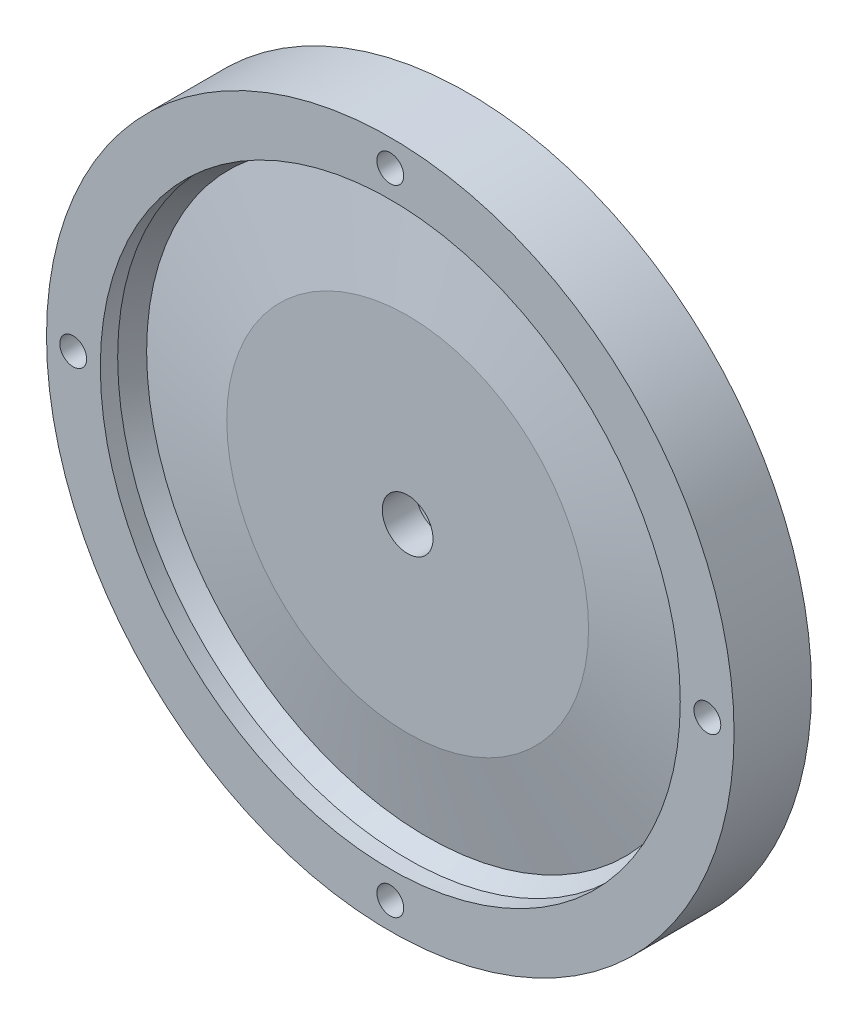
ISO-10303-21;
HEADER;
FILE_DESCRIPTION(('STEP AP214'),'2;1');
FILE_NAME('part.step','',(''),(''),'','','');
FILE_SCHEMA(('AUTOMOTIVE_DESIGN { 1 0 10303 214 1 1 1 1 }'));
ENDSEC;
DATA;
#1=APPLICATION_CONTEXT('core data for automotive mechanical design processes');
#2=APPLICATION_PROTOCOL_DEFINITION('international standard','automotive_design',2000,#1);
#3=PRODUCT_CONTEXT('',#1,'mechanical');
#4=PRODUCT('Part','Part','',(#3));
#5=PRODUCT_RELATED_PRODUCT_CATEGORY('part','',(#4));
#6=PRODUCT_DEFINITION_FORMATION('','',#4);
#7=PRODUCT_DEFINITION_CONTEXT('part definition',#1,'design');
#8=PRODUCT_DEFINITION('design','',#6,#7);
#9=PRODUCT_DEFINITION_SHAPE('','',#8);
#10=(LENGTH_UNIT() NAMED_UNIT(*) SI_UNIT(.MILLI.,.METRE.));
#11=(NAMED_UNIT(*) PLANE_ANGLE_UNIT() SI_UNIT($,.RADIAN.));
#12=(NAMED_UNIT(*) SI_UNIT($,.STERADIAN.) SOLID_ANGLE_UNIT());
#13=UNCERTAINTY_MEASURE_WITH_UNIT(LENGTH_MEASURE(1.E-05),#10,'distance_accuracy_value','');
#14=(GEOMETRIC_REPRESENTATION_CONTEXT(3) GLOBAL_UNCERTAINTY_ASSIGNED_CONTEXT((#13)) GLOBAL_UNIT_ASSIGNED_CONTEXT((#10,
#11,#12)) REPRESENTATION_CONTEXT('',''));
#15=CARTESIAN_POINT('',(0.,0.,0.));
#16=DIRECTION('',(0.,0.,1.));
#17=DIRECTION('',(1.,0.,0.));
#18=AXIS2_PLACEMENT_3D('',#15,#16,#17);
#19=CARTESIAN_POINT('',(0.,0.,5.08));
#20=DIRECTION('',(0.,0.,-1.));
#21=DIRECTION('',(-1.,0.,0.));
#22=AXIS2_PLACEMENT_3D('',#19,#20,#21);
#23=PLANE('',#22);
#24=CARTESIAN_POINT('',(0.,0.,5.08));
#25=DIRECTION('',(0.,0.,-1.));
#26=DIRECTION('',(-1.,0.,0.));
#27=AXIS2_PLACEMENT_3D('',#24,#25,#26);
#28=CIRCLE('',#27,4.826);
#29=CARTESIAN_POINT('',(-4.826,0.,5.08));
#30=VERTEX_POINT('',#29);
#31=EDGE_CURVE('E157',#30,#30,#28,.T.);
#32=ORIENTED_EDGE('',*,*,#31,.F.);
#33=EDGE_LOOP('',(#32));
#34=FACE_BOUND('',#33,.T.);
#35=CARTESIAN_POINT('',(0.,0.,5.08));
#36=DIRECTION('',(0.,0.,-1.));
#37=DIRECTION('',(-1.,0.,0.));
#38=AXIS2_PLACEMENT_3D('',#35,#36,#37);
#39=CIRCLE('',#38,45.72);
#40=CARTESIAN_POINT('',(-45.72,0.,5.08));
#41=VERTEX_POINT('',#40);
#42=EDGE_CURVE('E164',#41,#41,#39,.T.);
#43=ORIENTED_EDGE('',*,*,#42,.T.);
#44=EDGE_LOOP('',(#43));
#45=FACE_BOUND('',#44,.T.);
#46=DIRECTION('',(-1.,0.,0.));
#47=VECTOR('',#46,1.);
#48=CARTESIAN_POINT('',(-9.42734439012387,6.35,5.08));
#49=LINE('',#48,#47);
#50=CARTESIAN_POINT('',(-9.42734439012387,6.35,5.08));
#51=VERTEX_POINT('',#50);
#52=CARTESIAN_POINT('',(-13.2932059338596,6.35,5.08));
#53=VERTEX_POINT('',#52);
#54=EDGE_CURVE('E129',#51,#53,#49,.T.);
#55=ORIENTED_EDGE('',*,*,#54,.F.);
#56=CARTESIAN_POINT('',(0.,0.,5.08));
#57=DIRECTION('',(0.,0.,1.));
#58=DIRECTION('',(-1.,0.,0.));
#59=AXIS2_PLACEMENT_3D('',#56,#57,#58);
#60=CIRCLE('',#59,11.3665);
#61=CARTESIAN_POINT('',(9.42734439012387,6.35,5.08));
#62=VERTEX_POINT('',#61);
#63=EDGE_CURVE('E126',#62,#51,#60,.T.);
#64=ORIENTED_EDGE('',*,*,#63,.F.);
#65=DIRECTION('',(-1.,0.,0.));
#66=VECTOR('',#65,1.);
#67=CARTESIAN_POINT('',(13.2932059338596,6.35,5.08));
#68=LINE('',#67,#66);
#69=CARTESIAN_POINT('',(13.2932059338596,6.35,5.08));
#70=VERTEX_POINT('',#69);
#71=EDGE_CURVE('E138',#70,#62,#68,.T.);
#72=ORIENTED_EDGE('',*,*,#71,.F.);
#73=CARTESIAN_POINT('',(0.,0.,5.08));
#74=DIRECTION('',(0.,0.,-1.));
#75=DIRECTION('',(-1.,0.,0.));
#76=AXIS2_PLACEMENT_3D('',#73,#74,#75);
#77=CIRCLE('',#76,14.732);
#78=EDGE_CURVE('E146',#53,#70,#77,.T.);
#79=ORIENTED_EDGE('',*,*,#78,.F.);
#80=EDGE_LOOP('',(#55,#64,#72,#79));
#81=FACE_BOUND('',#80,.T.);
#82=DIRECTION('',(1.,0.,0.));
#83=VECTOR('',#82,1.);
#84=CARTESIAN_POINT('',(13.2932059338596,-6.35,5.08));
#85=LINE('',#84,#83);
#86=CARTESIAN_POINT('',(9.42734439012387,-6.35,5.08));
#87=VERTEX_POINT('',#86);
#88=CARTESIAN_POINT('',(13.2932059338596,-6.35,5.08));
#89=VERTEX_POINT('',#88);
#90=EDGE_CURVE('E462',#87,#89,#85,.T.);
#91=ORIENTED_EDGE('',*,*,#90,.F.);
#92=CARTESIAN_POINT('',(0.,0.,5.08));
#93=DIRECTION('',(0.,0.,1.));
#94=DIRECTION('',(-1.,0.,0.));
#95=AXIS2_PLACEMENT_3D('',#92,#93,#94);
#96=CIRCLE('',#95,11.3665);
#97=CARTESIAN_POINT('',(-9.42734439012387,-6.35,5.08));
#98=VERTEX_POINT('',#97);
#99=EDGE_CURVE('E124',#98,#87,#96,.T.);
#100=ORIENTED_EDGE('',*,*,#99,.F.);
#101=DIRECTION('',(1.,0.,0.));
#102=VECTOR('',#101,1.);
#103=CARTESIAN_POINT('',(-9.42734439012387,-6.35,5.08));
#104=LINE('',#103,#102);
#105=CARTESIAN_POINT('',(-13.2932059338596,-6.35,5.08));
#106=VERTEX_POINT('',#105);
#107=EDGE_CURVE('E120',#106,#98,#104,.T.);
#108=ORIENTED_EDGE('',*,*,#107,.F.);
#109=CARTESIAN_POINT('',(0.,0.,5.08));
#110=DIRECTION('',(0.,0.,-1.));
#111=DIRECTION('',(-1.,0.,0.));
#112=AXIS2_PLACEMENT_3D('',#109,#110,#111);
#113=CIRCLE('',#112,14.732);
#114=EDGE_CURVE('E459',#89,#106,#113,.T.);
#115=ORIENTED_EDGE('',*,*,#114,.F.);
#116=EDGE_LOOP('',(#91,#100,#108,#115));
#117=FACE_BOUND('',#116,.T.);
#118=ADVANCED_FACE('F35',(#34,#45,#81,#117),#23,.T.);
#119=CARTESIAN_POINT('',(0.,0.,14.732));
#120=DIRECTION('',(0.,0.,-1.));
#121=DIRECTION('',(-1.,0.,0.));
#122=AXIS2_PLACEMENT_3D('',#119,#120,#121);
#123=CYLINDRICAL_SURFACE('',#122,65.405);
#124=CARTESIAN_POINT('',(0.,0.,14.732));
#125=DIRECTION('',(0.,0.,1.));
#126=DIRECTION('',(1.,0.,0.));
#127=AXIS2_PLACEMENT_3D('',#124,#125,#126);
#128=CIRCLE('',#127,65.405);
#129=CARTESIAN_POINT('',(65.405,0.,14.732));
#130=VERTEX_POINT('',#129);
#131=EDGE_CURVE('E11',#130,#130,#128,.T.);
#132=ORIENTED_EDGE('',*,*,#131,.F.);
#133=EDGE_LOOP('',(#132));
#134=FACE_BOUND('',#133,.T.);
#135=CARTESIAN_POINT('',(0.,0.,0.));
#136=DIRECTION('',(0.,0.,1.));
#137=DIRECTION('',(1.,0.,0.));
#138=AXIS2_PLACEMENT_3D('',#135,#136,#137);
#139=CIRCLE('',#138,65.405);
#140=CARTESIAN_POINT('',(65.405,0.,0.));
#141=VERTEX_POINT('',#140);
#142=EDGE_CURVE('E39',#141,#141,#139,.T.);
#143=ORIENTED_EDGE('',*,*,#142,.T.);
#144=EDGE_LOOP('',(#143));
#145=FACE_BOUND('',#144,.T.);
#146=ADVANCED_FACE('F37',(#134,#145),#123,.T.);
#147=CARTESIAN_POINT('',(0.,0.,14.732));
#148=DIRECTION('',(0.,0.,1.));
#149=DIRECTION('',(1.,0.,0.));
#150=AXIS2_PLACEMENT_3D('',#147,#148,#149);
#151=PLANE('',#150);
#152=CARTESIAN_POINT('',(0.,60.325,14.732));
#153=DIRECTION('',(0.,0.,1.));
#154=DIRECTION('',(1.,0.,0.));
#155=AXIS2_PLACEMENT_3D('',#152,#153,#154);
#156=CIRCLE('',#155,2.5527);
#157=CARTESIAN_POINT('',(2.5527,60.325,14.732));
#158=VERTEX_POINT('',#157);
#159=EDGE_CURVE('E167',#158,#158,#156,.T.);
#160=ORIENTED_EDGE('',*,*,#159,.F.);
#161=EDGE_LOOP('',(#160));
#162=FACE_BOUND('',#161,.T.);
#163=CARTESIAN_POINT('',(60.325,0.,14.732));
#164=DIRECTION('',(0.,0.,1.));
#165=DIRECTION('',(1.,0.,0.));
#166=AXIS2_PLACEMENT_3D('',#163,#164,#165);
#167=CIRCLE('',#166,2.5527);
#168=CARTESIAN_POINT('',(62.8777,0.,14.732));
#169=VERTEX_POINT('',#168);
#170=EDGE_CURVE('E175',#169,#169,#167,.T.);
#171=ORIENTED_EDGE('',*,*,#170,.F.);
#172=EDGE_LOOP('',(#171));
#173=FACE_BOUND('',#172,.T.);
#174=CARTESIAN_POINT('',(0.,-60.325,14.732));
#175=DIRECTION('',(0.,0.,1.));
#176=DIRECTION('',(1.,0.,0.));
#177=AXIS2_PLACEMENT_3D('',#174,#175,#176);
#178=CIRCLE('',#177,2.5527);
#179=CARTESIAN_POINT('',(2.5527,-60.325,14.732));
#180=VERTEX_POINT('',#179);
#181=EDGE_CURVE('E181',#180,#180,#178,.T.);
#182=ORIENTED_EDGE('',*,*,#181,.F.);
#183=EDGE_LOOP('',(#182));
#184=FACE_BOUND('',#183,.T.);
#185=CARTESIAN_POINT('',(-60.325,0.,14.732));
#186=DIRECTION('',(0.,0.,1.));
#187=DIRECTION('',(1.,0.,0.));
#188=AXIS2_PLACEMENT_3D('',#185,#186,#187);
#189=CIRCLE('',#188,2.5527);
#190=CARTESIAN_POINT('',(-57.7723,0.,14.732));
#191=VERTEX_POINT('',#190);
#192=EDGE_CURVE('E187',#191,#191,#189,.T.);
#193=ORIENTED_EDGE('',*,*,#192,.F.);
#194=EDGE_LOOP('',(#193));
#195=FACE_BOUND('',#194,.T.);
#196=CARTESIAN_POINT('',(0.,0.,14.732));
#197=DIRECTION('',(0.,0.,1.));
#198=DIRECTION('',(1.,0.,0.));
#199=AXIS2_PLACEMENT_3D('',#196,#197,#198);
#200=CIRCLE('',#199,55.1688);
#201=CARTESIAN_POINT('',(55.1688,0.,14.732));
#202=VERTEX_POINT('',#201);
#203=EDGE_CURVE('E202',#202,#202,#200,.T.);
#204=ORIENTED_EDGE('',*,*,#203,.F.);
#205=EDGE_LOOP('',(#204));
#206=FACE_BOUND('',#205,.T.);
#207=ORIENTED_EDGE('',*,*,#131,.T.);
#208=EDGE_LOOP('',(#207));
#209=FACE_BOUND('',#208,.T.);
#210=ADVANCED_FACE('F213',(#162,#173,#184,#195,#206,#209),#151,.T.);
#211=CARTESIAN_POINT('',(0.,0.,0.));
#212=DIRECTION('',(0.,0.,1.));
#213=DIRECTION('',(1.,0.,0.));
#214=AXIS2_PLACEMENT_3D('',#211,#212,#213);
#215=PLANE('',#214);
#216=CARTESIAN_POINT('',(0.,0.,0.));
#217=DIRECTION('',(0.,0.,-1.));
#218=DIRECTION('',(-1.,0.,0.));
#219=AXIS2_PLACEMENT_3D('',#216,#217,#218);
#220=CIRCLE('',#219,45.72);
#221=CARTESIAN_POINT('',(-45.72,0.,0.));
#222=VERTEX_POINT('',#221);
#223=EDGE_CURVE('E163',#222,#222,#220,.T.);
#224=ORIENTED_EDGE('',*,*,#223,.F.);
#225=EDGE_LOOP('',(#224));
#226=FACE_BOUND('',#225,.T.);
#227=CARTESIAN_POINT('',(0.,60.325,0.));
#228=DIRECTION('',(0.,0.,1.));
#229=DIRECTION('',(1.,0.,0.));
#230=AXIS2_PLACEMENT_3D('',#227,#228,#229);
#231=CIRCLE('',#230,2.5527);
#232=CARTESIAN_POINT('',(2.5527,60.325,0.));
#233=VERTEX_POINT('',#232);
#234=EDGE_CURVE('E172',#233,#233,#231,.T.);
#235=ORIENTED_EDGE('',*,*,#234,.T.);
#236=EDGE_LOOP('',(#235));
#237=FACE_BOUND('',#236,.T.);
#238=CARTESIAN_POINT('',(60.325,0.,0.));
#239=DIRECTION('',(0.,0.,1.));
#240=DIRECTION('',(1.,0.,0.));
#241=AXIS2_PLACEMENT_3D('',#238,#239,#240);
#242=CIRCLE('',#241,2.5527);
#243=CARTESIAN_POINT('',(62.8777,0.,0.));
#244=VERTEX_POINT('',#243);
#245=EDGE_CURVE('E178',#244,#244,#242,.T.);
#246=ORIENTED_EDGE('',*,*,#245,.T.);
#247=EDGE_LOOP('',(#246));
#248=FACE_BOUND('',#247,.T.);
#249=CARTESIAN_POINT('',(0.,-60.325,0.));
#250=DIRECTION('',(0.,0.,1.));
#251=DIRECTION('',(1.,0.,0.));
#252=AXIS2_PLACEMENT_3D('',#249,#250,#251);
#253=CIRCLE('',#252,2.5527);
#254=CARTESIAN_POINT('',(2.5527,-60.325,0.));
#255=VERTEX_POINT('',#254);
#256=EDGE_CURVE('E184',#255,#255,#253,.T.);
#257=ORIENTED_EDGE('',*,*,#256,.T.);
#258=EDGE_LOOP('',(#257));
#259=FACE_BOUND('',#258,.T.);
#260=CARTESIAN_POINT('',(-60.325,0.,0.));
#261=DIRECTION('',(0.,0.,1.));
#262=DIRECTION('',(1.,0.,0.));
#263=AXIS2_PLACEMENT_3D('',#260,#261,#262);
#264=CIRCLE('',#263,2.5527);
#265=CARTESIAN_POINT('',(-57.7723,0.,0.));
#266=VERTEX_POINT('',#265);
#267=EDGE_CURVE('E190',#266,#266,#264,.T.);
#268=ORIENTED_EDGE('',*,*,#267,.T.);
#269=EDGE_LOOP('',(#268));
#270=FACE_BOUND('',#269,.T.);
#271=ORIENTED_EDGE('',*,*,#142,.F.);
#272=EDGE_LOOP('',(#271));
#273=FACE_BOUND('',#272,.T.);
#274=ADVANCED_FACE('F210',(#226,#237,#248,#259,#270,#273),#215,.F.);
#275=CARTESIAN_POINT('',(0.,0.,11.43));
#276=DIRECTION('',(0.,0.,1.));
#277=DIRECTION('',(1.,0.,0.));
#278=AXIS2_PLACEMENT_3D('',#275,#276,#277);
#279=CYLINDRICAL_SURFACE('',#278,55.1688);
#280=CARTESIAN_POINT('',(0.,0.,11.43));
#281=DIRECTION('',(0.,0.,-1.));
#282=DIRECTION('',(-1.,0.,0.));
#283=AXIS2_PLACEMENT_3D('',#280,#281,#282);
#284=CIRCLE('',#283,55.1688);
#285=CARTESIAN_POINT('',(-55.1688,0.,11.43));
#286=VERTEX_POINT('',#285);
#287=EDGE_CURVE('E199',#286,#286,#284,.T.);
#288=ORIENTED_EDGE('',*,*,#287,.T.);
#289=EDGE_LOOP('',(#288));
#290=FACE_BOUND('',#289,.T.);
#291=ORIENTED_EDGE('',*,*,#203,.T.);
#292=EDGE_LOOP('',(#291));
#293=FACE_BOUND('',#292,.T.);
#294=ADVANCED_FACE('F212',(#290,#293),#279,.F.);
#295=CARTESIAN_POINT('',(0.,0.,7.747));
#296=DIRECTION('',(0.,0.,1.));
#297=DIRECTION('',(1.,0.,0.));
#298=AXIS2_PLACEMENT_3D('',#295,#296,#297);
#299=CONICAL_SURFACE('',#298,53.34,0.460885185088275);
#300=ORIENTED_EDGE('',*,*,#287,.F.);
#301=EDGE_LOOP('',(#300));
#302=FACE_BOUND('',#301,.T.);
#303=CARTESIAN_POINT('',(0.,0.,7.747));
#304=DIRECTION('',(0.,0.,-1.));
#305=DIRECTION('',(-1.,0.,0.));
#306=AXIS2_PLACEMENT_3D('',#303,#304,#305);
#307=CIRCLE('',#306,53.34);
#308=CARTESIAN_POINT('',(-53.34,0.,7.747));
#309=VERTEX_POINT('',#308);
#310=EDGE_CURVE('E196',#309,#309,#307,.T.);
#311=ORIENTED_EDGE('',*,*,#310,.T.);
#312=EDGE_LOOP('',(#311));
#313=FACE_BOUND('',#312,.T.);
#314=ADVANCED_FACE('F220',(#302,#313),#299,.F.);
#315=CARTESIAN_POINT('',(0.,0.,11.43));
#316=DIRECTION('',(0.,0.,-1.));
#317=DIRECTION('',(-1.,0.,0.));
#318=AXIS2_PLACEMENT_3D('',#315,#316,#317);
#319=CONICAL_SURFACE('',#318,34.417,1.37856867959382);
#320=ORIENTED_EDGE('',*,*,#310,.F.);
#321=EDGE_LOOP('',(#320));
#322=FACE_BOUND('',#321,.T.);
#323=CARTESIAN_POINT('',(0.,0.,11.43));
#324=DIRECTION('',(0.,0.,-1.));
#325=DIRECTION('',(-1.,0.,0.));
#326=AXIS2_PLACEMENT_3D('',#323,#324,#325);
#327=CIRCLE('',#326,34.417);
#328=CARTESIAN_POINT('',(-34.417,0.,11.43));
#329=VERTEX_POINT('',#328);
#330=EDGE_CURVE('E193',#329,#329,#327,.T.);
#331=ORIENTED_EDGE('',*,*,#330,.T.);
#332=EDGE_LOOP('',(#331));
#333=FACE_BOUND('',#332,.T.);
#334=ADVANCED_FACE('F264',(#322,#333),#319,.T.);
#335=CARTESIAN_POINT('',(0.,0.,11.43));
#336=DIRECTION('',(0.,0.,1.));
#337=DIRECTION('',(1.,0.,0.));
#338=AXIS2_PLACEMENT_3D('',#335,#336,#337);
#339=PLANE('',#338);
#340=CARTESIAN_POINT('',(0.,0.,11.43));
#341=DIRECTION('',(0.,0.,1.));
#342=DIRECTION('',(1.,0.,0.));
#343=AXIS2_PLACEMENT_3D('',#340,#341,#342);
#344=CIRCLE('',#343,4.826);
#345=CARTESIAN_POINT('',(4.826,0.,11.43));
#346=VERTEX_POINT('',#345);
#347=EDGE_CURVE('E160',#346,#346,#344,.T.);
#348=ORIENTED_EDGE('',*,*,#347,.F.);
#349=EDGE_LOOP('',(#348));
#350=FACE_BOUND('',#349,.T.);
#351=ORIENTED_EDGE('',*,*,#330,.F.);
#352=EDGE_LOOP('',(#351));
#353=FACE_BOUND('',#352,.T.);
#354=ADVANCED_FACE('F262',(#350,#353),#339,.T.);
#355=CARTESIAN_POINT('',(-60.325,0.,14.732));
#356=DIRECTION('',(0.,0.,1.));
#357=DIRECTION('',(1.,0.,0.));
#358=AXIS2_PLACEMENT_3D('',#355,#356,#357);
#359=CYLINDRICAL_SURFACE('',#358,2.5527);
#360=ORIENTED_EDGE('',*,*,#267,.F.);
#361=EDGE_LOOP('',(#360));
#362=FACE_BOUND('',#361,.T.);
#363=ORIENTED_EDGE('',*,*,#192,.T.);
#364=EDGE_LOOP('',(#363));
#365=FACE_BOUND('',#364,.T.);
#366=ADVANCED_FACE('F258',(#362,#365),#359,.F.);
#367=CARTESIAN_POINT('',(0.,-60.325,14.732));
#368=DIRECTION('',(0.,0.,1.));
#369=DIRECTION('',(1.,0.,0.));
#370=AXIS2_PLACEMENT_3D('',#367,#368,#369);
#371=CYLINDRICAL_SURFACE('',#370,2.5527);
#372=ORIENTED_EDGE('',*,*,#256,.F.);
#373=EDGE_LOOP('',(#372));
#374=FACE_BOUND('',#373,.T.);
#375=ORIENTED_EDGE('',*,*,#181,.T.);
#376=EDGE_LOOP('',(#375));
#377=FACE_BOUND('',#376,.T.);
#378=ADVANCED_FACE('F254',(#374,#377),#371,.F.);
#379=CARTESIAN_POINT('',(60.325,0.,14.732));
#380=DIRECTION('',(0.,0.,1.));
#381=DIRECTION('',(1.,0.,0.));
#382=AXIS2_PLACEMENT_3D('',#379,#380,#381);
#383=CYLINDRICAL_SURFACE('',#382,2.5527);
#384=ORIENTED_EDGE('',*,*,#245,.F.);
#385=EDGE_LOOP('',(#384));
#386=FACE_BOUND('',#385,.T.);
#387=ORIENTED_EDGE('',*,*,#170,.T.);
#388=EDGE_LOOP('',(#387));
#389=FACE_BOUND('',#388,.T.);
#390=ADVANCED_FACE('F250',(#386,#389),#383,.F.);
#391=CARTESIAN_POINT('',(0.,60.325,14.732));
#392=DIRECTION('',(0.,0.,1.));
#393=DIRECTION('',(1.,0.,0.));
#394=AXIS2_PLACEMENT_3D('',#391,#392,#393);
#395=CYLINDRICAL_SURFACE('',#394,2.5527);
#396=ORIENTED_EDGE('',*,*,#234,.F.);
#397=EDGE_LOOP('',(#396));
#398=FACE_BOUND('',#397,.T.);
#399=ORIENTED_EDGE('',*,*,#159,.T.);
#400=EDGE_LOOP('',(#399));
#401=FACE_BOUND('',#400,.T.);
#402=ADVANCED_FACE('F246',(#398,#401),#395,.F.);
#403=CARTESIAN_POINT('',(0.,0.,5.08));
#404=DIRECTION('',(0.,0.,-1.));
#405=DIRECTION('',(-1.,0.,0.));
#406=AXIS2_PLACEMENT_3D('',#403,#404,#405);
#407=CYLINDRICAL_SURFACE('',#406,45.72);
#408=ORIENTED_EDGE('',*,*,#42,.F.);
#409=EDGE_LOOP('',(#408));
#410=FACE_BOUND('',#409,.T.);
#411=ORIENTED_EDGE('',*,*,#223,.T.);
#412=EDGE_LOOP('',(#411));
#413=FACE_BOUND('',#412,.T.);
#414=ADVANCED_FACE('F243',(#410,#413),#407,.F.);
#415=CARTESIAN_POINT('',(0.,0.,14.732));
#416=DIRECTION('',(0.,0.,-1.));
#417=DIRECTION('',(-1.,0.,0.));
#418=AXIS2_PLACEMENT_3D('',#415,#416,#417);
#419=CYLINDRICAL_SURFACE('',#418,4.826);
#420=ORIENTED_EDGE('',*,*,#347,.T.);
#421=EDGE_LOOP('',(#420));
#422=FACE_BOUND('',#421,.T.);
#423=ORIENTED_EDGE('',*,*,#31,.T.);
#424=EDGE_LOOP('',(#423));
#425=FACE_BOUND('',#424,.T.);
#426=ADVANCED_FACE('F241',(#422,#425),#419,.F.);
#427=CARTESIAN_POINT('',(0.,0.,-1.143));
#428=DIRECTION('',(0.,0.,1.));
#429=DIRECTION('',(1.,0.,0.));
#430=AXIS2_PLACEMENT_3D('',#427,#428,#429);
#431=CYLINDRICAL_SURFACE('',#430,11.3665);
#432=ORIENTED_EDGE('',*,*,#63,.T.);
#433=DIRECTION('',(0.,0.,1.));
#434=VECTOR('',#433,1.);
#435=CARTESIAN_POINT('',(-9.42734439012387,6.35,-1.143));
#436=LINE('',#435,#434);
#437=CARTESIAN_POINT('',(-9.42734439012387,6.35,-1.143));
#438=VERTEX_POINT('',#437);
#439=EDGE_CURVE('E155',#438,#51,#436,.T.);
#440=ORIENTED_EDGE('',*,*,#439,.F.);
#441=CARTESIAN_POINT('',(0.,0.,-1.143));
#442=DIRECTION('',(0.,0.,1.));
#443=DIRECTION('',(-1.,0.,0.));
#444=AXIS2_PLACEMENT_3D('',#441,#442,#443);
#445=CIRCLE('',#444,11.3665);
#446=CARTESIAN_POINT('',(9.42734439012387,6.35,-1.143));
#447=VERTEX_POINT('',#446);
#448=EDGE_CURVE('E134',#447,#438,#445,.T.);
#449=ORIENTED_EDGE('',*,*,#448,.F.);
#450=DIRECTION('',(0.,0.,1.));
#451=VECTOR('',#450,1.);
#452=CARTESIAN_POINT('',(9.42734439012387,6.35,-1.143));
#453=LINE('',#452,#451);
#454=EDGE_CURVE('E143',#447,#62,#453,.T.);
#455=ORIENTED_EDGE('',*,*,#454,.T.);
#456=EDGE_LOOP('',(#432,#440,#449,#455));
#457=FACE_BOUND('',#456,.T.);
#458=ADVANCED_FACE('F282',(#457),#431,.F.);
#459=CARTESIAN_POINT('',(-9.42734439012387,6.35,-1.143));
#460=DIRECTION('',(0.,1.,0.));
#461=DIRECTION('',(-1.,0.,0.));
#462=AXIS2_PLACEMENT_3D('',#459,#460,#461);
#463=PLANE('',#462);
#464=ORIENTED_EDGE('',*,*,#54,.T.);
#465=DIRECTION('',(0.,0.,1.));
#466=VECTOR('',#465,1.);
#467=CARTESIAN_POINT('',(-13.2932059338596,6.35,-1.143));
#468=LINE('',#467,#466);
#469=CARTESIAN_POINT('',(-13.2932059338596,6.35,-1.143));
#470=VERTEX_POINT('',#469);
#471=EDGE_CURVE('E152',#470,#53,#468,.T.);
#472=ORIENTED_EDGE('',*,*,#471,.F.);
#473=DIRECTION('',(-1.,0.,0.));
#474=VECTOR('',#473,1.);
#475=CARTESIAN_POINT('',(-9.42734439012387,6.35,-1.143));
#476=LINE('',#475,#474);
#477=EDGE_CURVE('E137',#438,#470,#476,.T.);
#478=ORIENTED_EDGE('',*,*,#477,.F.);
#479=ORIENTED_EDGE('',*,*,#439,.T.);
#480=EDGE_LOOP('',(#464,#472,#478,#479));
#481=FACE_BOUND('',#480,.T.);
#482=ADVANCED_FACE('F285',(#481),#463,.F.);
#483=CARTESIAN_POINT('',(0.,0.,-1.143));
#484=DIRECTION('',(0.,0.,1.));
#485=DIRECTION('',(1.,0.,0.));
#486=AXIS2_PLACEMENT_3D('',#483,#484,#485);
#487=CYLINDRICAL_SURFACE('',#486,14.732);
#488=ORIENTED_EDGE('',*,*,#78,.T.);
#489=DIRECTION('',(0.,0.,1.));
#490=VECTOR('',#489,1.);
#491=CARTESIAN_POINT('',(13.2932059338596,6.35,-1.143));
#492=LINE('',#491,#490);
#493=CARTESIAN_POINT('',(13.2932059338596,6.35,-1.143));
#494=VERTEX_POINT('',#493);
#495=EDGE_CURVE('E58',#494,#70,#492,.T.);
#496=ORIENTED_EDGE('',*,*,#495,.F.);
#497=CARTESIAN_POINT('',(0.,0.,-1.143));
#498=DIRECTION('',(0.,0.,-1.));
#499=DIRECTION('',(-1.,0.,0.));
#500=AXIS2_PLACEMENT_3D('',#497,#498,#499);
#501=CIRCLE('',#500,14.732);
#502=EDGE_CURVE('E140',#470,#494,#501,.T.);
#503=ORIENTED_EDGE('',*,*,#502,.F.);
#504=ORIENTED_EDGE('',*,*,#471,.T.);
#505=EDGE_LOOP('',(#488,#496,#503,#504));
#506=FACE_BOUND('',#505,.T.);
#507=ADVANCED_FACE('F289',(#506),#487,.T.);
#508=CARTESIAN_POINT('',(13.2932059338596,6.35,-1.143));
#509=DIRECTION('',(0.,1.,0.));
#510=DIRECTION('',(0.,0.,1.));
#511=AXIS2_PLACEMENT_3D('',#508,#509,#510);
#512=PLANE('',#511);
#513=ORIENTED_EDGE('',*,*,#71,.T.);
#514=ORIENTED_EDGE('',*,*,#454,.F.);
#515=DIRECTION('',(-1.,0.,0.));
#516=VECTOR('',#515,1.);
#517=CARTESIAN_POINT('',(13.2932059338596,6.35,-1.143));
#518=LINE('',#517,#516);
#519=EDGE_CURVE('E142',#494,#447,#518,.T.);
#520=ORIENTED_EDGE('',*,*,#519,.F.);
#521=ORIENTED_EDGE('',*,*,#495,.T.);
#522=EDGE_LOOP('',(#513,#514,#520,#521));
#523=FACE_BOUND('',#522,.T.);
#524=ADVANCED_FACE('F295',(#523),#512,.F.);
#525=CARTESIAN_POINT('',(0.,0.,-1.143));
#526=DIRECTION('',(0.,0.,-1.));
#527=DIRECTION('',(-1.,0.,0.));
#528=AXIS2_PLACEMENT_3D('',#525,#526,#527);
#529=PLANE('',#528);
#530=ORIENTED_EDGE('',*,*,#448,.T.);
#531=ORIENTED_EDGE('',*,*,#477,.T.);
#532=ORIENTED_EDGE('',*,*,#502,.T.);
#533=ORIENTED_EDGE('',*,*,#519,.T.);
#534=EDGE_LOOP('',(#530,#531,#532,#533));
#535=FACE_BOUND('',#534,.T.);
#536=ADVANCED_FACE('F299',(#535),#529,.T.);
#537=CARTESIAN_POINT('',(0.,0.,-1.143));
#538=DIRECTION('',(0.,0.,1.));
#539=DIRECTION('',(1.,0.,0.));
#540=AXIS2_PLACEMENT_3D('',#537,#538,#539);
#541=CYLINDRICAL_SURFACE('',#540,11.3665);
#542=ORIENTED_EDGE('',*,*,#99,.T.);
#543=DIRECTION('',(0.,0.,1.));
#544=VECTOR('',#543,1.);
#545=CARTESIAN_POINT('',(9.42734439012387,-6.35,-1.143));
#546=LINE('',#545,#544);
#547=CARTESIAN_POINT('',(9.42734439012387,-6.35,-1.143));
#548=VERTEX_POINT('',#547);
#549=EDGE_CURVE('E105',#548,#87,#546,.T.);
#550=ORIENTED_EDGE('',*,*,#549,.F.);
#551=CARTESIAN_POINT('',(0.,0.,-1.143));
#552=DIRECTION('',(0.,0.,1.));
#553=DIRECTION('',(-1.,0.,0.));
#554=AXIS2_PLACEMENT_3D('',#551,#552,#553);
#555=CIRCLE('',#554,11.3665);
#556=CARTESIAN_POINT('',(-9.42734439012387,-6.35,-1.143));
#557=VERTEX_POINT('',#556);
#558=EDGE_CURVE('E112',#557,#548,#555,.T.);
#559=ORIENTED_EDGE('',*,*,#558,.F.);
#560=DIRECTION('',(0.,0.,1.));
#561=VECTOR('',#560,1.);
#562=CARTESIAN_POINT('',(-9.42734439012387,-6.35,-1.143));
#563=LINE('',#562,#561);
#564=EDGE_CURVE('E456',#557,#98,#563,.T.);
#565=ORIENTED_EDGE('',*,*,#564,.T.);
#566=EDGE_LOOP('',(#542,#550,#559,#565));
#567=FACE_BOUND('',#566,.T.);
#568=ADVANCED_FACE('F122',(#567),#541,.F.);
#569=CARTESIAN_POINT('',(13.2932059338596,-6.35,-1.143));
#570=DIRECTION('',(0.,-1.,0.));
#571=DIRECTION('',(0.,0.,-1.));
#572=AXIS2_PLACEMENT_3D('',#569,#570,#571);
#573=PLANE('',#572);
#574=ORIENTED_EDGE('',*,*,#90,.T.);
#575=DIRECTION('',(0.,0.,1.));
#576=VECTOR('',#575,1.);
#577=CARTESIAN_POINT('',(13.2932059338596,-6.35,-1.143));
#578=LINE('',#577,#576);
#579=CARTESIAN_POINT('',(13.2932059338596,-6.35,-1.143));
#580=VERTEX_POINT('',#579);
#581=EDGE_CURVE('E108',#580,#89,#578,.T.);
#582=ORIENTED_EDGE('',*,*,#581,.F.);
#583=DIRECTION('',(1.,0.,0.));
#584=VECTOR('',#583,1.);
#585=CARTESIAN_POINT('',(13.2932059338596,-6.35,-1.143));
#586=LINE('',#585,#584);
#587=EDGE_CURVE('E101',#548,#580,#586,.T.);
#588=ORIENTED_EDGE('',*,*,#587,.F.);
#589=ORIENTED_EDGE('',*,*,#549,.T.);
#590=EDGE_LOOP('',(#574,#582,#588,#589));
#591=FACE_BOUND('',#590,.T.);
#592=ADVANCED_FACE('F103',(#591),#573,.F.);
#593=CARTESIAN_POINT('',(0.,0.,-1.143));
#594=DIRECTION('',(0.,0.,1.));
#595=DIRECTION('',(1.,0.,0.));
#596=AXIS2_PLACEMENT_3D('',#593,#594,#595);
#597=CYLINDRICAL_SURFACE('',#596,14.732);
#598=ORIENTED_EDGE('',*,*,#114,.T.);
#599=DIRECTION('',(0.,0.,1.));
#600=VECTOR('',#599,1.);
#601=CARTESIAN_POINT('',(-13.2932059338596,-6.35,-1.143));
#602=LINE('',#601,#600);
#603=CARTESIAN_POINT('',(-13.2932059338596,-6.35,-1.143));
#604=VERTEX_POINT('',#603);
#605=EDGE_CURVE('E50',#604,#106,#602,.T.);
#606=ORIENTED_EDGE('',*,*,#605,.F.);
#607=CARTESIAN_POINT('',(0.,0.,-1.143));
#608=DIRECTION('',(0.,0.,-1.));
#609=DIRECTION('',(-1.,0.,0.));
#610=AXIS2_PLACEMENT_3D('',#607,#608,#609);
#611=CIRCLE('',#610,14.732);
#612=EDGE_CURVE('E111',#580,#604,#611,.T.);
#613=ORIENTED_EDGE('',*,*,#612,.F.);
#614=ORIENTED_EDGE('',*,*,#581,.T.);
#615=EDGE_LOOP('',(#598,#606,#613,#614));
#616=FACE_BOUND('',#615,.T.);
#617=ADVANCED_FACE('F307',(#616),#597,.T.);
#618=CARTESIAN_POINT('',(-9.42734439012387,-6.35,-1.143));
#619=DIRECTION('',(0.,-1.,0.));
#620=DIRECTION('',(1.,0.,0.));
#621=AXIS2_PLACEMENT_3D('',#618,#619,#620);
#622=PLANE('',#621);
#623=ORIENTED_EDGE('',*,*,#107,.T.);
#624=ORIENTED_EDGE('',*,*,#564,.F.);
#625=DIRECTION('',(1.,0.,0.));
#626=VECTOR('',#625,1.);
#627=CARTESIAN_POINT('',(-9.42734439012387,-6.35,-1.143));
#628=LINE('',#627,#626);
#629=EDGE_CURVE('E116',#604,#557,#628,.T.);
#630=ORIENTED_EDGE('',*,*,#629,.F.);
#631=ORIENTED_EDGE('',*,*,#605,.T.);
#632=EDGE_LOOP('',(#623,#624,#630,#631));
#633=FACE_BOUND('',#632,.T.);
#634=ADVANCED_FACE('F310',(#633),#622,.F.);
#635=CARTESIAN_POINT('',(0.,0.,-1.143));
#636=DIRECTION('',(0.,0.,-1.));
#637=DIRECTION('',(-1.,0.,0.));
#638=AXIS2_PLACEMENT_3D('',#635,#636,#637);
#639=PLANE('',#638);
#640=ORIENTED_EDGE('',*,*,#558,.T.);
#641=ORIENTED_EDGE('',*,*,#587,.T.);
#642=ORIENTED_EDGE('',*,*,#612,.T.);
#643=ORIENTED_EDGE('',*,*,#629,.T.);
#644=EDGE_LOOP('',(#640,#641,#642,#643));
#645=FACE_BOUND('',#644,.T.);
#646=ADVANCED_FACE('F115',(#645),#639,.T.);
#647=CLOSED_SHELL('',(#118,#146,#210,#274,#294,#314,#334,#354,#366,#378,#390,#402,#414,#426,
#458,#482,#507,#524,#536,#568,#592,#617,#634,#646));
#648=MANIFOLD_SOLID_BREP('B2',#647);
#649=ADVANCED_BREP_SHAPE_REPRESENTATION('',(#18,#648),#14);
#650=SHAPE_DEFINITION_REPRESENTATION(#9,#649);
ENDSEC;
END-ISO-10303-21;
